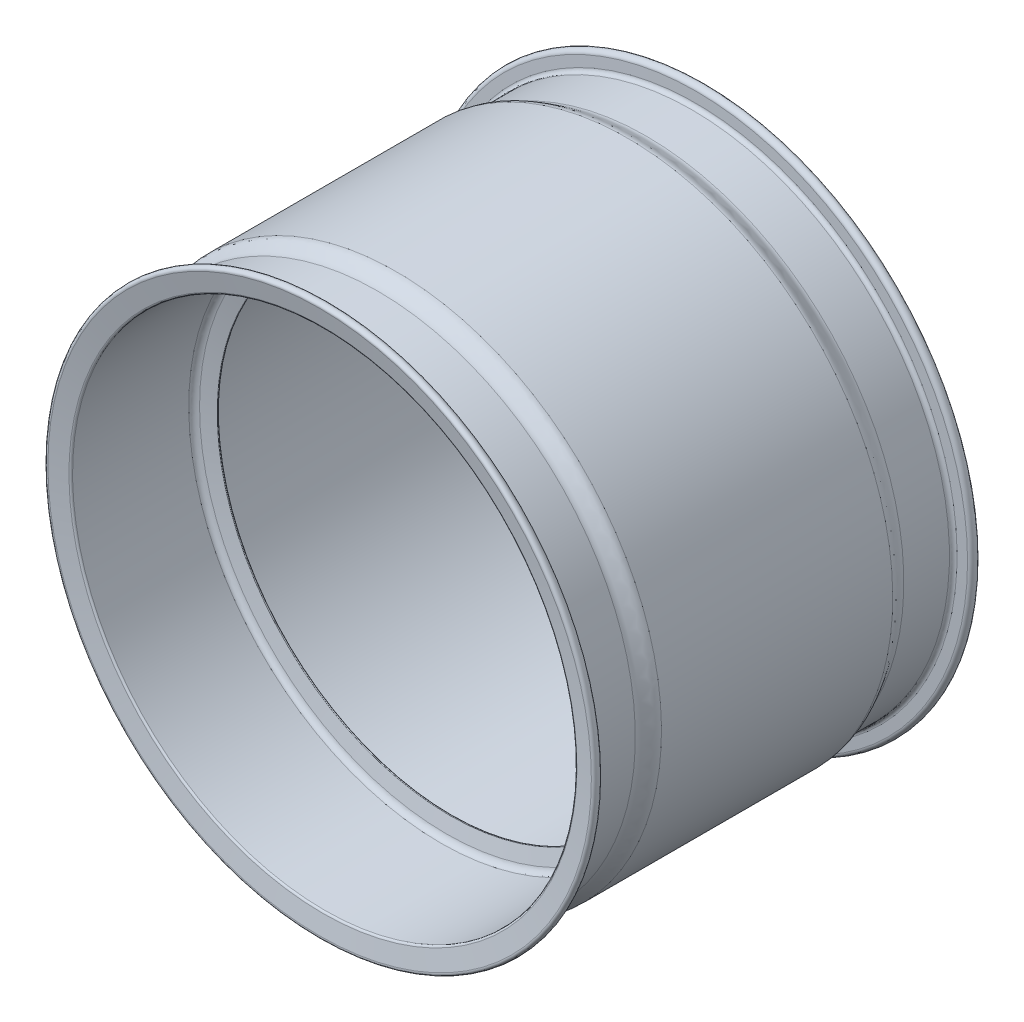
ISO-10303-21;
HEADER;
FILE_DESCRIPTION(('STEP AP214'),'2;1');
FILE_NAME('part.step','',(''),(''),'','','');
FILE_SCHEMA(('AUTOMOTIVE_DESIGN { 1 0 10303 214 1 1 1 1 }'));
ENDSEC;
DATA;
#1=APPLICATION_CONTEXT('core data for automotive mechanical design processes');
#2=APPLICATION_PROTOCOL_DEFINITION('international standard','automotive_design',2000,#1);
#3=PRODUCT_CONTEXT('',#1,'mechanical');
#4=PRODUCT('Part','Part','',(#3));
#5=PRODUCT_RELATED_PRODUCT_CATEGORY('part','',(#4));
#6=PRODUCT_DEFINITION_FORMATION('','',#4);
#7=PRODUCT_DEFINITION_CONTEXT('part definition',#1,'design');
#8=PRODUCT_DEFINITION('design','',#6,#7);
#9=PRODUCT_DEFINITION_SHAPE('','',#8);
#10=(LENGTH_UNIT() NAMED_UNIT(*) SI_UNIT(.MILLI.,.METRE.));
#11=(NAMED_UNIT(*) PLANE_ANGLE_UNIT() SI_UNIT($,.RADIAN.));
#12=(NAMED_UNIT(*) SI_UNIT($,.STERADIAN.) SOLID_ANGLE_UNIT());
#13=UNCERTAINTY_MEASURE_WITH_UNIT(LENGTH_MEASURE(1.E-05),#10,'distance_accuracy_value','');
#14=(GEOMETRIC_REPRESENTATION_CONTEXT(3) GLOBAL_UNCERTAINTY_ASSIGNED_CONTEXT((#13)) GLOBAL_UNIT_ASSIGNED_CONTEXT((#10,
#11,#12)) REPRESENTATION_CONTEXT('',''));
#15=CARTESIAN_POINT('',(0.,0.,0.));
#16=DIRECTION('',(0.,0.,1.));
#17=DIRECTION('',(1.,0.,0.));
#18=AXIS2_PLACEMENT_3D('',#15,#16,#17);
#19=CARTESIAN_POINT('',(2179.59090909091,2825.,4154.04214273197));
#20=DIRECTION('',(0.,0.,1.));
#21=DIRECTION('',(0.,-1.,0.));
#22=AXIS2_PLACEMENT_3D('',#19,#20,#21);
#23=CYLINDRICAL_SURFACE('',#22,721.179115055064);
#24=CARTESIAN_POINT('',(2179.59090909091,2825.,4810.31771800641));
#25=DIRECTION('',(0.,0.,1.));
#26=DIRECTION('',(0.,-1.,0.));
#27=AXIS2_PLACEMENT_3D('',#24,#25,#26);
#28=CIRCLE('',#27,721.179115055066);
#29=CARTESIAN_POINT('',(2179.59090909091,2103.82088494493,4810.31771800641));
#30=VERTEX_POINT('',#29);
#31=EDGE_CURVE('E10',#30,#30,#28,.T.);
#32=ORIENTED_EDGE('',*,*,#31,.T.);
#33=EDGE_LOOP('',(#32));
#34=FACE_BOUND('',#33,.T.);
#35=CARTESIAN_POINT('',(2179.59090909091,2825.,4122.98452546699));
#36=DIRECTION('',(0.,0.,1.));
#37=DIRECTION('',(0.,-1.,0.));
#38=AXIS2_PLACEMENT_3D('',#35,#36,#37);
#39=CIRCLE('',#38,721.179115055062);
#40=CARTESIAN_POINT('',(2179.59090909091,2103.82088494494,4122.98452546699));
#41=VERTEX_POINT('',#40);
#42=EDGE_CURVE('E215',#41,#41,#39,.T.);
#43=ORIENTED_EDGE('',*,*,#42,.F.);
#44=EDGE_LOOP('',(#43));
#45=FACE_BOUND('',#44,.T.);
#46=ADVANCED_FACE('F15',(#34,#45),#23,.F.);
#47=CARTESIAN_POINT('',(2179.59090909091,2825.,4810.31771800641));
#48=DIRECTION('',(0.,0.,-1.));
#49=DIRECTION('',(0.,1.,0.));
#50=AXIS2_PLACEMENT_3D('',#47,#48,#49);
#51=CONICAL_SURFACE('',#50,721.179115055066,0.0244340149573436);
#52=CARTESIAN_POINT('',(2179.59090909091,2825.,4813.9097758312));
#53=DIRECTION('',(0.,0.,1.));
#54=DIRECTION('',(0.,-1.,0.));
#55=AXIS2_PLACEMENT_3D('',#52,#53,#54);
#56=CIRCLE('',#55,721.091329189748);
#57=CARTESIAN_POINT('',(2179.59090909091,2103.90867081025,4813.9097758312));
#58=VERTEX_POINT('',#57);
#59=EDGE_CURVE('E21',#58,#58,#56,.T.);
#60=ORIENTED_EDGE('',*,*,#59,.T.);
#61=EDGE_LOOP('',(#60));
#62=FACE_BOUND('',#61,.T.);
#63=ORIENTED_EDGE('',*,*,#31,.F.);
#64=EDGE_LOOP('',(#63));
#65=FACE_BOUND('',#64,.T.);
#66=ADVANCED_FACE('F208',(#62,#65),#51,.F.);
#67=CARTESIAN_POINT('',(2179.59090909091,2825.,4829.37926396353));
#68=DIRECTION('',(0.,0.,-1.));
#69=DIRECTION('',(0.,1.,0.));
#70=AXIS2_PLACEMENT_3D('',#67,#68,#69);
#71=CONICAL_SURFACE('',#70,669.40637050296,1.27997866155326);
#72=ORIENTED_EDGE('',*,*,#59,.F.);
#73=EDGE_LOOP('',(#72));
#74=FACE_BOUND('',#73,.T.);
#75=CARTESIAN_POINT('',(2179.59090909091,2825.,4829.37926396353));
#76=DIRECTION('',(0.,0.,1.));
#77=DIRECTION('',(0.,-1.,0.));
#78=AXIS2_PLACEMENT_3D('',#75,#76,#77);
#79=CIRCLE('',#78,669.40637050296);
#80=CARTESIAN_POINT('',(2179.59090909091,2155.59362949704,4829.37926396353));
#81=VERTEX_POINT('',#80);
#82=EDGE_CURVE('E25',#81,#81,#79,.T.);
#83=ORIENTED_EDGE('',*,*,#82,.T.);
#84=EDGE_LOOP('',(#83));
#85=FACE_BOUND('',#84,.T.);
#86=ADVANCED_FACE('F139',(#74,#85),#71,.F.);
#87=CARTESIAN_POINT('',(2179.59090909091,3494.40637050296,4829.37926396353));
#88=CARTESIAN_POINT('',(2179.59090909091,3491.36723955013,4830.28888644175));
#89=CARTESIAN_POINT('',(2179.59090909091,3487.63100382925,4835.16712382428));
#90=CARTESIAN_POINT('',(2179.59090909091,3490.44745653853,4835.84549522952));
#91=B_SPLINE_CURVE_WITH_KNOTS('',3,(#87,#88,#89,#90),.UNSPECIFIED.,.F.,.F.,(4,4),(0.,1.),.UNSPECIFIED.);
#92=CARTESIAN_POINT('',(2179.59090909091,2825.,4154.04214273197));
#93=DIRECTION('',(0.,0.,1.));
#94=AXIS1_PLACEMENT('',#92,#93);
#95=SURFACE_OF_REVOLUTION('',#91,#94);
#96=CARTESIAN_POINT('',(2179.59090909091,2825.,4835.84549522952));
#97=DIRECTION('',(0.,0.,1.));
#98=DIRECTION('',(0.,-1.,0.));
#99=AXIS2_PLACEMENT_3D('',#96,#97,#98);
#100=CIRCLE('',#99,665.447456538525);
#101=CARTESIAN_POINT('',(2179.59090909091,2159.55254346148,4835.84549522952));
#102=VERTEX_POINT('',#101);
#103=EDGE_CURVE('E29',#102,#102,#100,.T.);
#104=ORIENTED_EDGE('',*,*,#103,.T.);
#105=EDGE_LOOP('',(#104));
#106=FACE_BOUND('',#105,.T.);
#107=ORIENTED_EDGE('',*,*,#82,.F.);
#108=EDGE_LOOP('',(#107));
#109=FACE_BOUND('',#108,.T.);
#110=ADVANCED_FACE('F135',(#106,#109),#95,.F.);
#111=CARTESIAN_POINT('',(2179.59090909091,2825.,4845.57952369557));
#112=DIRECTION('',(0.,0.,1.));
#113=DIRECTION('',(0.,-1.,0.));
#114=AXIS2_PLACEMENT_3D('',#111,#112,#113);
#115=CONICAL_SURFACE('',#114,705.861056866308,1.33443813978017);
#116=ORIENTED_EDGE('',*,*,#103,.F.);
#117=EDGE_LOOP('',(#116));
#118=FACE_BOUND('',#117,.T.);
#119=CARTESIAN_POINT('',(2179.59090909091,2825.,4845.57952369557));
#120=DIRECTION('',(0.,0.,1.));
#121=DIRECTION('',(0.,-1.,0.));
#122=AXIS2_PLACEMENT_3D('',#119,#120,#121);
#123=CIRCLE('',#122,705.861056866308);
#124=CARTESIAN_POINT('',(2179.59090909091,2119.13894313369,4845.57952369557));
#125=VERTEX_POINT('',#124);
#126=EDGE_CURVE('E34',#125,#125,#123,.T.);
#127=ORIENTED_EDGE('',*,*,#126,.T.);
#128=EDGE_LOOP('',(#127));
#129=FACE_BOUND('',#128,.T.);
#130=ADVANCED_FACE('F131',(#118,#129),#115,.F.);
#131=CARTESIAN_POINT('',(2179.59090909091,3530.86105686631,4845.57952369557));
#132=CARTESIAN_POINT('',(2179.59090909091,3539.13783855351,4847.5730711127));
#133=CARTESIAN_POINT('',(2179.59090909091,3546.17911505506,4853.32278660503));
#134=CARTESIAN_POINT('',(2179.59090909091,3546.17911505506,4861.223498016));
#135=B_SPLINE_CURVE_WITH_KNOTS('',3,(#131,#132,#133,#134),.UNSPECIFIED.,.F.,.F.,(4,4),(0.,1.),.UNSPECIFIED.);
#136=CARTESIAN_POINT('',(2179.59090909091,2825.,4154.04214273197));
#137=DIRECTION('',(0.,0.,1.));
#138=AXIS1_PLACEMENT('',#136,#137);
#139=SURFACE_OF_REVOLUTION('',#135,#138);
#140=CARTESIAN_POINT('',(2179.59090909091,2825.,4861.223498016));
#141=DIRECTION('',(0.,0.,1.));
#142=DIRECTION('',(0.,-1.,0.));
#143=AXIS2_PLACEMENT_3D('',#140,#141,#142);
#144=CIRCLE('',#143,721.179115055064);
#145=CARTESIAN_POINT('',(2179.59090909091,2103.82088494494,4861.223498016));
#146=VERTEX_POINT('',#145);
#147=EDGE_CURVE('E37',#146,#146,#144,.T.);
#148=ORIENTED_EDGE('',*,*,#147,.T.);
#149=EDGE_LOOP('',(#148));
#150=FACE_BOUND('',#149,.T.);
#151=ORIENTED_EDGE('',*,*,#126,.F.);
#152=EDGE_LOOP('',(#151));
#153=FACE_BOUND('',#152,.T.);
#154=ADVANCED_FACE('F127',(#150,#153),#139,.F.);
#155=CARTESIAN_POINT('',(2179.59090909091,2825.,4154.04214273197));
#156=DIRECTION('',(0.,0.,1.));
#157=DIRECTION('',(0.,-1.,0.));
#158=AXIS2_PLACEMENT_3D('',#155,#156,#157);
#159=CYLINDRICAL_SURFACE('',#158,721.179115055062);
#160=CARTESIAN_POINT('',(2179.59090909091,2825.,5193.38509663282));
#161=DIRECTION('',(0.,0.,1.));
#162=DIRECTION('',(0.,-1.,0.));
#163=AXIS2_PLACEMENT_3D('',#160,#161,#162);
#164=CIRCLE('',#163,721.179115055061);
#165=CARTESIAN_POINT('',(2179.59090909091,2103.82088494494,5193.38509663282));
#166=VERTEX_POINT('',#165);
#167=EDGE_CURVE('E40',#166,#166,#164,.T.);
#168=ORIENTED_EDGE('',*,*,#167,.T.);
#169=EDGE_LOOP('',(#168));
#170=FACE_BOUND('',#169,.T.);
#171=ORIENTED_EDGE('',*,*,#147,.F.);
#172=EDGE_LOOP('',(#171));
#173=FACE_BOUND('',#172,.T.);
#174=ADVANCED_FACE('F123',(#170,#173),#159,.F.);
#175=CARTESIAN_POINT('',(2179.59090909091,3551.16618202824,5198.71676306143));
#176=CARTESIAN_POINT('',(2179.59090909091,3548.4011526096,5198.20062423662));
#177=CARTESIAN_POINT('',(2179.59090909091,3546.17911505506,5196.08071934823));
#178=CARTESIAN_POINT('',(2179.59090909091,3546.17911505506,5193.38509663282));
#179=B_SPLINE_CURVE_WITH_KNOTS('',3,(#175,#176,#177,#178),.UNSPECIFIED.,.F.,.F.,(4,4),(0.,1.),.UNSPECIFIED.);
#180=CARTESIAN_POINT('',(2179.59090909091,2825.,4154.04214273197));
#181=DIRECTION('',(0.,0.,1.));
#182=AXIS1_PLACEMENT('',#180,#181);
#183=SURFACE_OF_REVOLUTION('',#179,#182);
#184=ORIENTED_EDGE('',*,*,#167,.F.);
#185=EDGE_LOOP('',(#184));
#186=FACE_BOUND('',#185,.T.);
#187=CARTESIAN_POINT('',(2179.59090909091,2825.,5198.71676306143));
#188=DIRECTION('',(0.,0.,1.));
#189=DIRECTION('',(0.,-1.,0.));
#190=AXIS2_PLACEMENT_3D('',#187,#188,#189);
#191=CIRCLE('',#190,726.166182028236);
#192=CARTESIAN_POINT('',(2179.59090909091,2098.83381797176,5198.71676306143));
#193=VERTEX_POINT('',#192);
#194=EDGE_CURVE('E43',#193,#193,#191,.T.);
#195=ORIENTED_EDGE('',*,*,#194,.T.);
#196=EDGE_LOOP('',(#195));
#197=FACE_BOUND('',#196,.T.);
#198=ADVANCED_FACE('F120',(#186,#197),#183,.T.);
#199=CARTESIAN_POINT('',(2179.59090909091,2825.,5198.71676306143));
#200=DIRECTION('',(0.,0.,1.));
#201=DIRECTION('',(0.,-1.,0.));
#202=AXIS2_PLACEMENT_3D('',#199,#200,#201);
#203=CONICAL_SURFACE('',#202,726.166182028236,1.38625352960428);
#204=CARTESIAN_POINT('',(2179.59090909091,2825.,5208.1848110498));
#205=DIRECTION('',(0.,0.,1.));
#206=DIRECTION('',(0.,-1.,0.));
#207=AXIS2_PLACEMENT_3D('',#204,#205,#206);
#208=CIRCLE('',#207,776.887867680218);
#209=CARTESIAN_POINT('',(2179.59090909091,2048.11213231978,5208.1848110498));
#210=VERTEX_POINT('',#209);
#211=EDGE_CURVE('E46',#210,#210,#208,.T.);
#212=ORIENTED_EDGE('',*,*,#211,.T.);
#213=EDGE_LOOP('',(#212));
#214=FACE_BOUND('',#213,.T.);
#215=ORIENTED_EDGE('',*,*,#194,.F.);
#216=EDGE_LOOP('',(#215));
#217=FACE_BOUND('',#216,.T.);
#218=ADVANCED_FACE('F99',(#214,#217),#203,.F.);
#219=CARTESIAN_POINT('',(2179.59090909091,3600.79676583452,5184.80299176144));
#220=CARTESIAN_POINT('',(2179.59090909091,3615.62388812196,5185.55611543318));
#221=CARTESIAN_POINT('',(2179.59090909091,3615.86845431008,5210.79452055404));
#222=CARTESIAN_POINT('',(2179.59090909091,3601.88786768022,5208.1848110498));
#223=B_SPLINE_CURVE_WITH_KNOTS('',3,(#219,#220,#221,#222),.UNSPECIFIED.,.F.,.F.,(4,4),(0.,1.),.UNSPECIFIED.);
#224=CARTESIAN_POINT('',(2179.59090909091,2825.,4154.04214273197));
#225=DIRECTION('',(0.,0.,1.));
#226=AXIS1_PLACEMENT('',#224,#225);
#227=SURFACE_OF_REVOLUTION('',#223,#226);
#228=ORIENTED_EDGE('',*,*,#211,.F.);
#229=EDGE_LOOP('',(#228));
#230=FACE_BOUND('',#229,.T.);
#231=CARTESIAN_POINT('',(2179.59090909091,2825.,5184.80299176144));
#232=DIRECTION('',(0.,0.,1.));
#233=DIRECTION('',(0.,-1.,0.));
#234=AXIS2_PLACEMENT_3D('',#231,#232,#233);
#235=CIRCLE('',#234,775.796765834514);
#236=CARTESIAN_POINT('',(2179.59090909091,2049.20323416549,5184.80299176144));
#237=VERTEX_POINT('',#236);
#238=EDGE_CURVE('E49',#237,#237,#235,.T.);
#239=ORIENTED_EDGE('',*,*,#238,.T.);
#240=EDGE_LOOP('',(#239));
#241=FACE_BOUND('',#240,.T.);
#242=ADVANCED_FACE('F95',(#230,#241),#227,.T.);
#243=CARTESIAN_POINT('',(2179.59090909091,2825.,5184.80299176144));
#244=DIRECTION('',(0.,0.,1.));
#245=DIRECTION('',(0.,-1.,0.));
#246=AXIS2_PLACEMENT_3D('',#243,#244,#245);
#247=CONICAL_SURFACE('',#246,775.796765834514,1.52004629095966);
#248=CARTESIAN_POINT('',(2179.59090909091,2825.,5183.35459856046));
#249=DIRECTION('',(0.,0.,1.));
#250=DIRECTION('',(0.,-1.,0.));
#251=AXIS2_PLACEMENT_3D('',#248,#249,#250);
#252=CIRCLE('',#251,747.281524690308);
#253=CARTESIAN_POINT('',(2179.59090909091,2077.71847530969,5183.35459856046));
#254=VERTEX_POINT('',#253);
#255=EDGE_CURVE('E52',#254,#254,#252,.T.);
#256=ORIENTED_EDGE('',*,*,#255,.T.);
#257=EDGE_LOOP('',(#256));
#258=FACE_BOUND('',#257,.T.);
#259=ORIENTED_EDGE('',*,*,#238,.F.);
#260=EDGE_LOOP('',(#259));
#261=FACE_BOUND('',#260,.T.);
#262=ADVANCED_FACE('F91',(#258,#261),#247,.T.);
#263=CARTESIAN_POINT('',(2179.59090909091,3561.41857568299,5172.38819289593));
#264=CARTESIAN_POINT('',(2179.59090909091,3561.41857568299,5178.30611900287));
#265=CARTESIAN_POINT('',(2179.59090909091,3566.27297562468,5183.04940241744));
#266=CARTESIAN_POINT('',(2179.59090909091,3572.28152469031,5183.35459856046));
#267=B_SPLINE_CURVE_WITH_KNOTS('',3,(#263,#264,#265,#266),.UNSPECIFIED.,.F.,.F.,(4,4),(0.,1.),.UNSPECIFIED.);
#268=CARTESIAN_POINT('',(2179.59090909091,2825.,4154.04214273197));
#269=DIRECTION('',(0.,0.,1.));
#270=AXIS1_PLACEMENT('',#268,#269);
#271=SURFACE_OF_REVOLUTION('',#267,#270);
#272=ORIENTED_EDGE('',*,*,#255,.F.);
#273=EDGE_LOOP('',(#272));
#274=FACE_BOUND('',#273,.T.);
#275=CARTESIAN_POINT('',(2179.59090909091,2825.,5172.38819289593));
#276=DIRECTION('',(0.,0.,1.));
#277=DIRECTION('',(0.,-1.,0.));
#278=AXIS2_PLACEMENT_3D('',#275,#276,#277);
#279=CIRCLE('',#278,736.41857568299);
#280=CARTESIAN_POINT('',(2179.59090909091,2088.58142431701,5172.38819289593));
#281=VERTEX_POINT('',#280);
#282=EDGE_CURVE('E55',#281,#281,#279,.T.);
#283=ORIENTED_EDGE('',*,*,#282,.T.);
#284=EDGE_LOOP('',(#283));
#285=FACE_BOUND('',#284,.T.);
#286=ADVANCED_FACE('F87',(#274,#285),#271,.T.);
#287=CARTESIAN_POINT('',(2179.59090909091,2825.,4154.04214273197));
#288=DIRECTION('',(0.,0.,1.));
#289=DIRECTION('',(0.,-1.,0.));
#290=AXIS2_PLACEMENT_3D('',#287,#288,#289);
#291=CYLINDRICAL_SURFACE('',#290,736.41857568299);
#292=CARTESIAN_POINT('',(2179.59090909091,2825.,5041.99153491134));
#293=DIRECTION('',(0.,0.,1.));
#294=DIRECTION('',(0.,-1.,0.));
#295=AXIS2_PLACEMENT_3D('',#292,#293,#294);
#296=CIRCLE('',#295,736.418575682989);
#297=CARTESIAN_POINT('',(2179.59090909091,2088.58142431701,5041.99153491134));
#298=VERTEX_POINT('',#297);
#299=EDGE_CURVE('E58',#298,#298,#296,.T.);
#300=ORIENTED_EDGE('',*,*,#299,.T.);
#301=EDGE_LOOP('',(#300));
#302=FACE_BOUND('',#301,.T.);
#303=ORIENTED_EDGE('',*,*,#282,.F.);
#304=EDGE_LOOP('',(#303));
#305=FACE_BOUND('',#304,.T.);
#306=ADVANCED_FACE('F82',(#302,#305),#291,.T.);
#307=CARTESIAN_POINT('',(2179.59090909091,3582.99616821241,4988.79474482842));
#308=CARTESIAN_POINT('',(2179.59090909091,3582.99616821241,5008.6584995397));
#309=CARTESIAN_POINT('',(2179.59090909091,3561.41857568299,5022.12778020006));
#310=CARTESIAN_POINT('',(2179.59090909091,3561.41857568299,5041.99153491134));
#311=B_SPLINE_CURVE_WITH_KNOTS('',3,(#307,#308,#309,#310),.UNSPECIFIED.,.F.,.F.,(4,4),(0.,1.),.UNSPECIFIED.);
#312=CARTESIAN_POINT('',(2179.59090909091,2825.,4154.04214273197));
#313=DIRECTION('',(0.,0.,1.));
#314=AXIS1_PLACEMENT('',#312,#313);
#315=SURFACE_OF_REVOLUTION('',#311,#314);
#316=ORIENTED_EDGE('',*,*,#299,.F.);
#317=EDGE_LOOP('',(#316));
#318=FACE_BOUND('',#317,.T.);
#319=CARTESIAN_POINT('',(2179.59090909091,2825.,4988.79474482842));
#320=DIRECTION('',(0.,0.,1.));
#321=DIRECTION('',(0.,-1.,0.));
#322=AXIS2_PLACEMENT_3D('',#319,#320,#321);
#323=CIRCLE('',#322,757.996168212409);
#324=CARTESIAN_POINT('',(2179.59090909091,2067.00383178759,4988.79474482842));
#325=VERTEX_POINT('',#324);
#326=EDGE_CURVE('E61',#325,#325,#323,.T.);
#327=ORIENTED_EDGE('',*,*,#326,.T.);
#328=EDGE_LOOP('',(#327));
#329=FACE_BOUND('',#328,.T.);
#330=ADVANCED_FACE('F77',(#318,#329),#315,.T.);
#331=CARTESIAN_POINT('',(2179.59090909091,2825.,4154.04214273197));
#332=DIRECTION('',(0.,0.,1.));
#333=DIRECTION('',(0.,-1.,0.));
#334=AXIS2_PLACEMENT_3D('',#331,#332,#333);
#335=CYLINDRICAL_SURFACE('',#334,757.99616821241);
#336=ORIENTED_EDGE('',*,*,#326,.F.);
#337=EDGE_LOOP('',(#336));
#338=FACE_BOUND('',#337,.T.);
#339=CARTESIAN_POINT('',(2179.59090909091,2825.,4327.57487727138));
#340=DIRECTION('',(0.,0.,1.));
#341=DIRECTION('',(0.,-1.,0.));
#342=AXIS2_PLACEMENT_3D('',#339,#340,#341);
#343=CIRCLE('',#342,757.99616821241);
#344=CARTESIAN_POINT('',(2179.59090909091,2067.00383178759,4327.57487727138));
#345=VERTEX_POINT('',#344);
#346=EDGE_CURVE('E64',#345,#345,#343,.T.);
#347=ORIENTED_EDGE('',*,*,#346,.T.);
#348=EDGE_LOOP('',(#347));
#349=FACE_BOUND('',#348,.T.);
#350=ADVANCED_FACE('F81',(#338,#349),#335,.T.);
#351=CARTESIAN_POINT('',(2179.59090909091,3600.79676583452,4131.56663033838));
#352=CARTESIAN_POINT('',(2179.59090909091,3615.62388812196,4130.81350666663));
#353=CARTESIAN_POINT('',(2179.59090909091,3615.86845431008,4105.57510154576));
#354=CARTESIAN_POINT('',(2179.59090909091,3601.88786768023,4108.18481105));
#355=B_SPLINE_CURVE_WITH_KNOTS('',3,(#351,#352,#353,#354),.UNSPECIFIED.,.F.,.F.,(4,4),(0.,1.),.UNSPECIFIED.);
#356=CARTESIAN_POINT('',(2179.59090909091,2825.,3849.77632881897));
#357=DIRECTION('',(0.,0.,1.));
#358=AXIS1_PLACEMENT('',#356,#357);
#359=SURFACE_OF_REVOLUTION('',#355,#358);
#360=CARTESIAN_POINT('',(2179.59090909091,2825.,4108.18481105));
#361=DIRECTION('',(0.,0.,1.));
#362=DIRECTION('',(0.,-1.,0.));
#363=AXIS2_PLACEMENT_3D('',#360,#361,#362);
#364=CIRCLE('',#363,776.88786768022);
#365=CARTESIAN_POINT('',(2179.59090909091,2048.11213231978,4108.18481105));
#366=VERTEX_POINT('',#365);
#367=EDGE_CURVE('E221',#366,#366,#364,.T.);
#368=ORIENTED_EDGE('',*,*,#367,.T.);
#369=EDGE_LOOP('',(#368));
#370=FACE_BOUND('',#369,.T.);
#371=CARTESIAN_POINT('',(2179.59090909091,2825.,4131.56663033838));
#372=DIRECTION('',(0.,0.,1.));
#373=DIRECTION('',(0.,-1.,0.));
#374=AXIS2_PLACEMENT_3D('',#371,#372,#373);
#375=CIRCLE('',#374,775.796765834517);
#376=CARTESIAN_POINT('',(2179.59090909091,2049.20323416548,4131.56663033838));
#377=VERTEX_POINT('',#376);
#378=EDGE_CURVE('E190',#377,#377,#375,.T.);
#379=ORIENTED_EDGE('',*,*,#378,.F.);
#380=EDGE_LOOP('',(#379));
#381=FACE_BOUND('',#380,.T.);
#382=ADVANCED_FACE('F195',(#370,#381),#359,.F.);
#383=CARTESIAN_POINT('',(2179.59090909091,2825.,4117.65285903838));
#384=DIRECTION('',(0.,0.,-1.));
#385=DIRECTION('',(0.,1.,0.));
#386=AXIS2_PLACEMENT_3D('',#383,#384,#385);
#387=CONICAL_SURFACE('',#386,726.166182028237,1.38625352960428);
#388=ORIENTED_EDGE('',*,*,#367,.F.);
#389=EDGE_LOOP('',(#388));
#390=FACE_BOUND('',#389,.T.);
#391=CARTESIAN_POINT('',(2179.59090909091,2825.,4117.65285903838));
#392=DIRECTION('',(0.,0.,1.));
#393=DIRECTION('',(0.,-1.,0.));
#394=AXIS2_PLACEMENT_3D('',#391,#392,#393);
#395=CIRCLE('',#394,726.166182028237);
#396=CARTESIAN_POINT('',(2179.59090909091,2098.83381797176,4117.65285903838));
#397=VERTEX_POINT('',#396);
#398=EDGE_CURVE('E216',#397,#397,#395,.T.);
#399=ORIENTED_EDGE('',*,*,#398,.T.);
#400=EDGE_LOOP('',(#399));
#401=FACE_BOUND('',#400,.T.);
#402=ADVANCED_FACE('F165',(#390,#401),#387,.F.);
#403=CARTESIAN_POINT('',(2179.59090909091,3551.16618202824,4117.65285903838));
#404=CARTESIAN_POINT('',(2179.59090909091,3548.4011526096,4118.16899786318));
#405=CARTESIAN_POINT('',(2179.59090909091,3546.17911505506,4120.28890275158));
#406=CARTESIAN_POINT('',(2179.59090909091,3546.17911505506,4122.98452546699));
#407=B_SPLINE_CURVE_WITH_KNOTS('',3,(#403,#404,#405,#406),.UNSPECIFIED.,.F.,.F.,(4,4),(0.,1.),.UNSPECIFIED.);
#408=CARTESIAN_POINT('',(2179.59090909091,2825.,3849.77632881897));
#409=DIRECTION('',(0.,0.,1.));
#410=AXIS1_PLACEMENT('',#408,#409);
#411=SURFACE_OF_REVOLUTION('',#407,#410);
#412=ORIENTED_EDGE('',*,*,#42,.T.);
#413=EDGE_LOOP('',(#412));
#414=FACE_BOUND('',#413,.T.);
#415=ORIENTED_EDGE('',*,*,#398,.F.);
#416=EDGE_LOOP('',(#415));
#417=FACE_BOUND('',#416,.T.);
#418=ADVANCED_FACE('F160',(#414,#417),#411,.F.);
#419=CARTESIAN_POINT('',(2179.59090909091,2825.,4131.56663033838));
#420=DIRECTION('',(0.,0.,-1.));
#421=DIRECTION('',(0.,1.,0.));
#422=AXIS2_PLACEMENT_3D('',#419,#420,#421);
#423=CONICAL_SURFACE('',#422,775.796765834517,1.52004629095967);
#424=CARTESIAN_POINT('',(2179.59090909091,2825.,4133.01502353934));
#425=DIRECTION('',(0.,0.,1.));
#426=DIRECTION('',(0.,-1.,0.));
#427=AXIS2_PLACEMENT_3D('',#424,#425,#426);
#428=CIRCLE('',#427,747.281524690309);
#429=CARTESIAN_POINT('',(2179.59090909091,2077.71847530969,4133.01502353934));
#430=VERTEX_POINT('',#429);
#431=EDGE_CURVE('E219',#430,#430,#428,.T.);
#432=ORIENTED_EDGE('',*,*,#431,.F.);
#433=EDGE_LOOP('',(#432));
#434=FACE_BOUND('',#433,.T.);
#435=ORIENTED_EDGE('',*,*,#378,.T.);
#436=EDGE_LOOP('',(#435));
#437=FACE_BOUND('',#436,.T.);
#438=ADVANCED_FACE('F164',(#434,#437),#423,.T.);
#439=CARTESIAN_POINT('',(2179.59090909091,3561.41857568299,4143.98142920388));
#440=CARTESIAN_POINT('',(2179.59090909091,3561.41857568299,4138.06350309694));
#441=CARTESIAN_POINT('',(2179.59090909091,3566.27297562468,4133.32021968236));
#442=CARTESIAN_POINT('',(2179.59090909091,3572.28152469031,4133.01502353934));
#443=B_SPLINE_CURVE_WITH_KNOTS('',3,(#439,#440,#441,#442),.UNSPECIFIED.,.F.,.F.,(4,4),(0.,1.),.UNSPECIFIED.);
#444=CARTESIAN_POINT('',(2179.59090909091,2825.,3849.77632881897));
#445=DIRECTION('',(0.,0.,1.));
#446=AXIS1_PLACEMENT('',#444,#445);
#447=SURFACE_OF_REVOLUTION('',#443,#446);
#448=ORIENTED_EDGE('',*,*,#431,.T.);
#449=EDGE_LOOP('',(#448));
#450=FACE_BOUND('',#449,.T.);
#451=CARTESIAN_POINT('',(2179.59090909091,2825.,4143.98142920388));
#452=DIRECTION('',(0.,0.,1.));
#453=DIRECTION('',(0.,-1.,0.));
#454=AXIS2_PLACEMENT_3D('',#451,#452,#453);
#455=CIRCLE('',#454,736.418575682992);
#456=CARTESIAN_POINT('',(2179.59090909091,2088.58142431701,4143.98142920388));
#457=VERTEX_POINT('',#456);
#458=EDGE_CURVE('E230',#457,#457,#455,.T.);
#459=ORIENTED_EDGE('',*,*,#458,.F.);
#460=EDGE_LOOP('',(#459));
#461=FACE_BOUND('',#460,.T.);
#462=ADVANCED_FACE('F175',(#450,#461),#447,.F.);
#463=CARTESIAN_POINT('',(2179.59090909091,2825.,3849.77632881897));
#464=DIRECTION('',(0.,0.,1.));
#465=DIRECTION('',(0.,-1.,0.));
#466=AXIS2_PLACEMENT_3D('',#463,#464,#465);
#467=CYLINDRICAL_SURFACE('',#466,736.418575682991);
#468=CARTESIAN_POINT('',(2179.59090909091,2825.,4274.37808718847));
#469=DIRECTION('',(0.,0.,1.));
#470=DIRECTION('',(0.,-1.,0.));
#471=AXIS2_PLACEMENT_3D('',#468,#469,#470);
#472=CIRCLE('',#471,736.41857568299);
#473=CARTESIAN_POINT('',(2179.59090909091,2088.58142431701,4274.37808718847));
#474=VERTEX_POINT('',#473);
#475=EDGE_CURVE('E227',#474,#474,#472,.T.);
#476=ORIENTED_EDGE('',*,*,#475,.F.);
#477=EDGE_LOOP('',(#476));
#478=FACE_BOUND('',#477,.T.);
#479=ORIENTED_EDGE('',*,*,#458,.T.);
#480=EDGE_LOOP('',(#479));
#481=FACE_BOUND('',#480,.T.);
#482=ADVANCED_FACE('F171',(#478,#481),#467,.T.);
#483=CARTESIAN_POINT('',(2179.59090909091,3582.99616821242,4327.57487727138));
#484=CARTESIAN_POINT('',(2179.59090909091,3582.99616821241,4307.71112256011));
#485=CARTESIAN_POINT('',(2179.59090909091,3561.41857568299,4294.24184189974));
#486=CARTESIAN_POINT('',(2179.59090909091,3561.41857568299,4274.37808718847));
#487=B_SPLINE_CURVE_WITH_KNOTS('',3,(#483,#484,#485,#486),.UNSPECIFIED.,.F.,.F.,(4,4),(0.,1.),.UNSPECIFIED.);
#488=CARTESIAN_POINT('',(2179.59090909091,2825.,3849.77632881897));
#489=DIRECTION('',(0.,0.,1.));
#490=AXIS1_PLACEMENT('',#488,#489);
#491=SURFACE_OF_REVOLUTION('',#487,#490);
#492=ORIENTED_EDGE('',*,*,#475,.T.);
#493=EDGE_LOOP('',(#492));
#494=FACE_BOUND('',#493,.T.);
#495=ORIENTED_EDGE('',*,*,#346,.F.);
#496=EDGE_LOOP('',(#495));
#497=FACE_BOUND('',#496,.T.);
#498=ADVANCED_FACE('F168',(#494,#497),#491,.F.);
#499=CLOSED_SHELL('',(#46,#66,#86,#110,#130,#154,#174,#198,#218,#242,#262,#286,#306,#330,#350,
#382,#402,#418,#438,#462,#482,#498));
#500=MANIFOLD_SOLID_BREP('B1',#499);
#501=ADVANCED_BREP_SHAPE_REPRESENTATION('',(#18,#500),#14);
#502=SHAPE_DEFINITION_REPRESENTATION(#9,#501);
ENDSEC;
END-ISO-10303-21;
